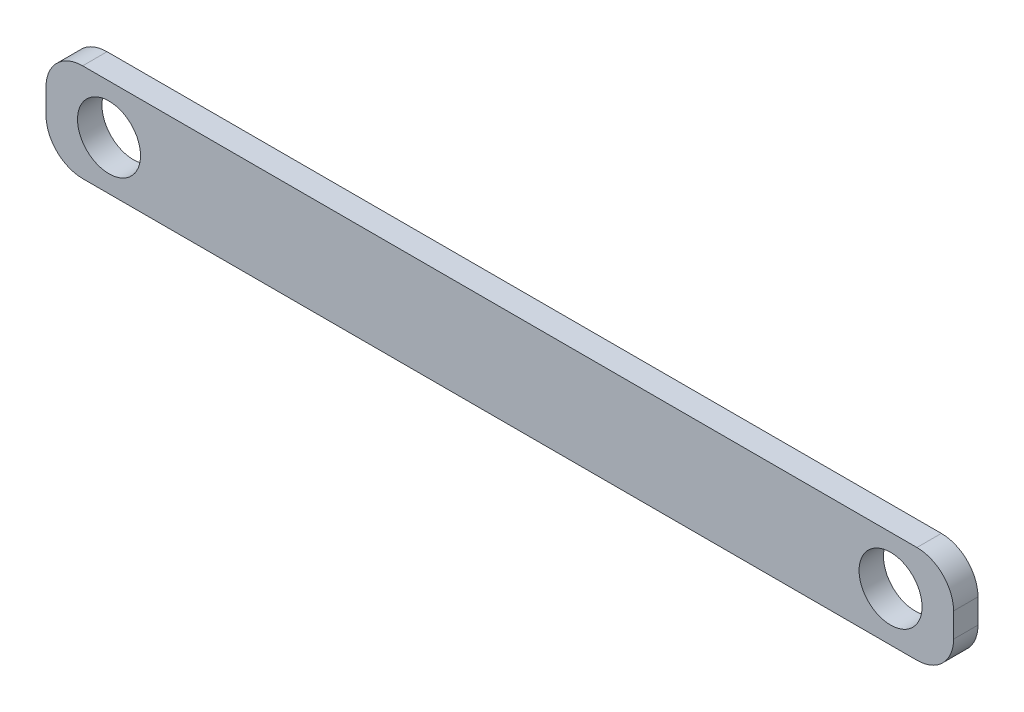
ISO-10303-21;
HEADER;
FILE_DESCRIPTION(('STEP AP214'),'2;1');
FILE_NAME('part.step','',(''),(''),'','','');
FILE_SCHEMA(('AUTOMOTIVE_DESIGN { 1 0 10303 214 1 1 1 1 }'));
ENDSEC;
DATA;
#1=APPLICATION_CONTEXT('core data for automotive mechanical design processes');
#2=APPLICATION_PROTOCOL_DEFINITION('international standard','automotive_design',2000,#1);
#3=PRODUCT_CONTEXT('',#1,'mechanical');
#4=PRODUCT('Part','Part','',(#3));
#5=PRODUCT_RELATED_PRODUCT_CATEGORY('part','',(#4));
#6=PRODUCT_DEFINITION_FORMATION('','',#4);
#7=PRODUCT_DEFINITION_CONTEXT('part definition',#1,'design');
#8=PRODUCT_DEFINITION('design','',#6,#7);
#9=PRODUCT_DEFINITION_SHAPE('','',#8);
#10=(LENGTH_UNIT() NAMED_UNIT(*) SI_UNIT(.MILLI.,.METRE.));
#11=(NAMED_UNIT(*) PLANE_ANGLE_UNIT() SI_UNIT($,.RADIAN.));
#12=(NAMED_UNIT(*) SI_UNIT($,.STERADIAN.) SOLID_ANGLE_UNIT());
#13=UNCERTAINTY_MEASURE_WITH_UNIT(LENGTH_MEASURE(1.E-05),#10,'distance_accuracy_value','');
#14=(GEOMETRIC_REPRESENTATION_CONTEXT(3) GLOBAL_UNCERTAINTY_ASSIGNED_CONTEXT((#13)) GLOBAL_UNIT_ASSIGNED_CONTEXT((#10,
#11,#12)) REPRESENTATION_CONTEXT('',''));
#15=CARTESIAN_POINT('',(0.,0.,0.));
#16=DIRECTION('',(0.,0.,1.));
#17=DIRECTION('',(1.,0.,0.));
#18=AXIS2_PLACEMENT_3D('',#15,#16,#17);
#19=CARTESIAN_POINT('',(0.,0.,5.));
#20=DIRECTION('',(0.,0.,-1.));
#21=DIRECTION('',(-1.,0.,0.));
#22=AXIS2_PLACEMENT_3D('',#19,#20,#21);
#23=PLANE('',#22);
#24=CARTESIAN_POINT('',(-80.,0.,5.));
#25=DIRECTION('',(0.,0.,1.));
#26=DIRECTION('',(1.,0.,0.));
#27=AXIS2_PLACEMENT_3D('',#24,#25,#26);
#28=CIRCLE('',#27,6.45);
#29=CARTESIAN_POINT('',(-73.55,0.,5.));
#30=VERTEX_POINT('',#29);
#31=EDGE_CURVE('E133',#30,#30,#28,.T.);
#32=ORIENTED_EDGE('',*,*,#31,.F.);
#33=EDGE_LOOP('',(#32));
#34=FACE_BOUND('',#33,.T.);
#35=DIRECTION('',(0.,-1.,0.));
#36=VECTOR('',#35,1.);
#37=CARTESIAN_POINT('',(-92.9,-10.,5.));
#38=LINE('',#37,#36);
#39=CARTESIAN_POINT('',(-92.9,2.49999999999999,5.));
#40=VERTEX_POINT('',#39);
#41=CARTESIAN_POINT('',(-92.9,-2.50000000000001,5.));
#42=VERTEX_POINT('',#41);
#43=EDGE_CURVE('E138',#40,#42,#38,.T.);
#44=ORIENTED_EDGE('',*,*,#43,.T.);
#45=CARTESIAN_POINT('',(-85.4,-2.50000000000001,5.));
#46=DIRECTION('',(0.,0.,-1.));
#47=DIRECTION('',(-1.,0.,0.));
#48=AXIS2_PLACEMENT_3D('',#45,#46,#47);
#49=CIRCLE('',#48,7.5);
#50=CARTESIAN_POINT('',(-85.4,-10.,5.));
#51=VERTEX_POINT('',#50);
#52=EDGE_CURVE('E152',#42,#51,#49,.F.);
#53=ORIENTED_EDGE('',*,*,#52,.T.);
#54=DIRECTION('',(1.,0.,0.));
#55=VECTOR('',#54,1.);
#56=CARTESIAN_POINT('',(-92.9,-10.,5.));
#57=LINE('',#56,#55);
#58=CARTESIAN_POINT('',(85.3999999999999,-9.99999999999999,5.));
#59=VERTEX_POINT('',#58);
#60=EDGE_CURVE('E119',#51,#59,#57,.T.);
#61=ORIENTED_EDGE('',*,*,#60,.T.);
#62=CARTESIAN_POINT('',(85.4,-2.49999999999999,5.));
#63=DIRECTION('',(0.,0.,-1.));
#64=DIRECTION('',(-1.,0.,0.));
#65=AXIS2_PLACEMENT_3D('',#62,#63,#64);
#66=CIRCLE('',#65,7.5);
#67=CARTESIAN_POINT('',(92.9,-2.49999999999999,5.));
#68=VERTEX_POINT('',#67);
#69=EDGE_CURVE('E148',#59,#68,#66,.F.);
#70=ORIENTED_EDGE('',*,*,#69,.T.);
#71=DIRECTION('',(0.,1.,0.));
#72=VECTOR('',#71,1.);
#73=CARTESIAN_POINT('',(92.9,-9.99999999999999,5.));
#74=LINE('',#73,#72);
#75=CARTESIAN_POINT('',(92.9,2.50000000000001,5.));
#76=VERTEX_POINT('',#75);
#77=EDGE_CURVE('E161',#68,#76,#74,.T.);
#78=ORIENTED_EDGE('',*,*,#77,.T.);
#79=CARTESIAN_POINT('',(85.4,2.50000000000001,5.));
#80=DIRECTION('',(0.,0.,-1.));
#81=DIRECTION('',(-1.,0.,0.));
#82=AXIS2_PLACEMENT_3D('',#79,#80,#81);
#83=CIRCLE('',#82,7.5);
#84=CARTESIAN_POINT('',(85.3999999999999,10.,5.));
#85=VERTEX_POINT('',#84);
#86=EDGE_CURVE('E54',#76,#85,#83,.F.);
#87=ORIENTED_EDGE('',*,*,#86,.T.);
#88=DIRECTION('',(-1.,0.,0.));
#89=VECTOR('',#88,1.);
#90=CARTESIAN_POINT('',(-92.9,9.99999999999999,5.));
#91=LINE('',#90,#89);
#92=CARTESIAN_POINT('',(-85.4,9.99999999999999,5.));
#93=VERTEX_POINT('',#92);
#94=EDGE_CURVE('E139',#85,#93,#91,.T.);
#95=ORIENTED_EDGE('',*,*,#94,.T.);
#96=CARTESIAN_POINT('',(-85.4,2.49999999999999,5.));
#97=DIRECTION('',(0.,0.,-1.));
#98=DIRECTION('',(-1.,0.,0.));
#99=AXIS2_PLACEMENT_3D('',#96,#97,#98);
#100=CIRCLE('',#99,7.5);
#101=EDGE_CURVE('E150',#93,#40,#100,.F.);
#102=ORIENTED_EDGE('',*,*,#101,.T.);
#103=EDGE_LOOP('',(#44,#53,#61,#70,#78,#87,#95,#102));
#104=FACE_BOUND('',#103,.T.);
#105=CARTESIAN_POINT('',(80.,0.,5.));
#106=DIRECTION('',(0.,0.,1.));
#107=DIRECTION('',(-1.,0.,0.));
#108=AXIS2_PLACEMENT_3D('',#105,#106,#107);
#109=CIRCLE('',#108,6.45);
#110=CARTESIAN_POINT('',(73.55,0.,5.));
#111=VERTEX_POINT('',#110);
#112=EDGE_CURVE('E184',#111,#111,#109,.T.);
#113=ORIENTED_EDGE('',*,*,#112,.F.);
#114=EDGE_LOOP('',(#113));
#115=FACE_BOUND('',#114,.T.);
#116=ADVANCED_FACE('F32',(#34,#104,#115),#23,.F.);
#117=CARTESIAN_POINT('',(0.,0.,0.));
#118=DIRECTION('',(0.,0.,-1.));
#119=DIRECTION('',(-1.,0.,0.));
#120=AXIS2_PLACEMENT_3D('',#117,#118,#119);
#121=PLANE('',#120);
#122=CARTESIAN_POINT('',(-80.,0.,0.));
#123=DIRECTION('',(0.,0.,1.));
#124=DIRECTION('',(1.,0.,0.));
#125=AXIS2_PLACEMENT_3D('',#122,#123,#124);
#126=CIRCLE('',#125,6.45);
#127=CARTESIAN_POINT('',(-73.55,0.,0.));
#128=VERTEX_POINT('',#127);
#129=EDGE_CURVE('E181',#128,#128,#126,.T.);
#130=ORIENTED_EDGE('',*,*,#129,.T.);
#131=EDGE_LOOP('',(#130));
#132=FACE_BOUND('',#131,.T.);
#133=DIRECTION('',(1.,0.,0.));
#134=VECTOR('',#133,1.);
#135=CARTESIAN_POINT('',(-92.9,-10.,0.));
#136=LINE('',#135,#134);
#137=CARTESIAN_POINT('',(-85.4,-10.,0.));
#138=VERTEX_POINT('',#137);
#139=CARTESIAN_POINT('',(85.3999999999999,-9.99999999999999,0.));
#140=VERTEX_POINT('',#139);
#141=EDGE_CURVE('E116',#138,#140,#136,.T.);
#142=ORIENTED_EDGE('',*,*,#141,.F.);
#143=CARTESIAN_POINT('',(-85.4,-2.50000000000001,0.));
#144=DIRECTION('',(0.,0.,-1.));
#145=DIRECTION('',(-1.,0.,0.));
#146=AXIS2_PLACEMENT_3D('',#143,#144,#145);
#147=CIRCLE('',#146,7.5);
#148=CARTESIAN_POINT('',(-92.9,-2.50000000000001,0.));
#149=VERTEX_POINT('',#148);
#150=EDGE_CURVE('E99',#138,#149,#147,.T.);
#151=ORIENTED_EDGE('',*,*,#150,.T.);
#152=DIRECTION('',(0.,-1.,0.));
#153=VECTOR('',#152,1.);
#154=CARTESIAN_POINT('',(-92.9,-10.,0.));
#155=LINE('',#154,#153);
#156=CARTESIAN_POINT('',(-92.9,2.49999999999999,0.));
#157=VERTEX_POINT('',#156);
#158=EDGE_CURVE('E128',#157,#149,#155,.T.);
#159=ORIENTED_EDGE('',*,*,#158,.F.);
#160=CARTESIAN_POINT('',(-85.4,2.49999999999999,0.));
#161=DIRECTION('',(0.,0.,-1.));
#162=DIRECTION('',(-1.,0.,0.));
#163=AXIS2_PLACEMENT_3D('',#160,#161,#162);
#164=CIRCLE('',#163,7.5);
#165=CARTESIAN_POINT('',(-85.4,9.99999999999999,0.));
#166=VERTEX_POINT('',#165);
#167=EDGE_CURVE('E110',#157,#166,#164,.T.);
#168=ORIENTED_EDGE('',*,*,#167,.T.);
#169=DIRECTION('',(-1.,0.,0.));
#170=VECTOR('',#169,1.);
#171=CARTESIAN_POINT('',(-92.9,9.99999999999999,0.));
#172=LINE('',#171,#170);
#173=CARTESIAN_POINT('',(85.3999999999999,10.,0.));
#174=VERTEX_POINT('',#173);
#175=EDGE_CURVE('E131',#174,#166,#172,.T.);
#176=ORIENTED_EDGE('',*,*,#175,.F.);
#177=CARTESIAN_POINT('',(85.4,2.50000000000001,0.));
#178=DIRECTION('',(0.,0.,-1.));
#179=DIRECTION('',(-1.,0.,0.));
#180=AXIS2_PLACEMENT_3D('',#177,#178,#179);
#181=CIRCLE('',#180,7.5);
#182=CARTESIAN_POINT('',(92.9,2.50000000000001,0.));
#183=VERTEX_POINT('',#182);
#184=EDGE_CURVE('E120',#174,#183,#181,.T.);
#185=ORIENTED_EDGE('',*,*,#184,.T.);
#186=DIRECTION('',(0.,1.,0.));
#187=VECTOR('',#186,1.);
#188=CARTESIAN_POINT('',(92.9,-9.99999999999999,0.));
#189=LINE('',#188,#187);
#190=CARTESIAN_POINT('',(92.9,-2.49999999999999,0.));
#191=VERTEX_POINT('',#190);
#192=EDGE_CURVE('E127',#191,#183,#189,.T.);
#193=ORIENTED_EDGE('',*,*,#192,.F.);
#194=CARTESIAN_POINT('',(85.4,-2.49999999999999,0.));
#195=DIRECTION('',(0.,0.,-1.));
#196=DIRECTION('',(-1.,0.,0.));
#197=AXIS2_PLACEMENT_3D('',#194,#195,#196);
#198=CIRCLE('',#197,7.5);
#199=EDGE_CURVE('E126',#191,#140,#198,.T.);
#200=ORIENTED_EDGE('',*,*,#199,.T.);
#201=EDGE_LOOP('',(#142,#151,#159,#168,#176,#185,#193,#200));
#202=FACE_BOUND('',#201,.T.);
#203=CARTESIAN_POINT('',(80.,0.,0.));
#204=DIRECTION('',(0.,0.,1.));
#205=DIRECTION('',(-1.,0.,0.));
#206=AXIS2_PLACEMENT_3D('',#203,#204,#205);
#207=CIRCLE('',#206,6.45);
#208=CARTESIAN_POINT('',(73.55,0.,0.));
#209=VERTEX_POINT('',#208);
#210=EDGE_CURVE('E187',#209,#209,#207,.T.);
#211=ORIENTED_EDGE('',*,*,#210,.T.);
#212=EDGE_LOOP('',(#211));
#213=FACE_BOUND('',#212,.T.);
#214=ADVANCED_FACE('F123',(#132,#202,#213),#121,.T.);
#215=CARTESIAN_POINT('',(-92.9,-10.,5.));
#216=DIRECTION('',(1.,0.,0.));
#217=DIRECTION('',(0.,0.,-1.));
#218=AXIS2_PLACEMENT_3D('',#215,#216,#217);
#219=PLANE('',#218);
#220=ORIENTED_EDGE('',*,*,#158,.T.);
#221=DIRECTION('',(0.,0.,-1.));
#222=VECTOR('',#221,1.);
#223=CARTESIAN_POINT('',(-92.9,-2.50000000000001,5.));
#224=LINE('',#223,#222);
#225=EDGE_CURVE('E104',#149,#42,#224,.F.);
#226=ORIENTED_EDGE('',*,*,#225,.T.);
#227=ORIENTED_EDGE('',*,*,#43,.F.);
#228=DIRECTION('',(0.,0.,-1.));
#229=VECTOR('',#228,1.);
#230=CARTESIAN_POINT('',(-92.9,2.49999999999999,5.));
#231=LINE('',#230,#229);
#232=EDGE_CURVE('E109',#40,#157,#231,.T.);
#233=ORIENTED_EDGE('',*,*,#232,.T.);
#234=EDGE_LOOP('',(#220,#226,#227,#233));
#235=FACE_BOUND('',#234,.T.);
#236=ADVANCED_FACE('F177',(#235),#219,.F.);
#237=CARTESIAN_POINT('',(-92.9,-10.,5.));
#238=DIRECTION('',(0.,1.,0.));
#239=DIRECTION('',(-1.,0.,0.));
#240=AXIS2_PLACEMENT_3D('',#237,#238,#239);
#241=PLANE('',#240);
#242=ORIENTED_EDGE('',*,*,#60,.F.);
#243=DIRECTION('',(0.,0.,-1.));
#244=VECTOR('',#243,1.);
#245=CARTESIAN_POINT('',(-85.4,-10.,5.));
#246=LINE('',#245,#244);
#247=EDGE_CURVE('E103',#51,#138,#246,.T.);
#248=ORIENTED_EDGE('',*,*,#247,.T.);
#249=ORIENTED_EDGE('',*,*,#141,.T.);
#250=DIRECTION('',(0.,0.,-1.));
#251=VECTOR('',#250,1.);
#252=CARTESIAN_POINT('',(85.4,-9.99999999999999,5.));
#253=LINE('',#252,#251);
#254=EDGE_CURVE('E121',#140,#59,#253,.F.);
#255=ORIENTED_EDGE('',*,*,#254,.T.);
#256=EDGE_LOOP('',(#242,#248,#249,#255));
#257=FACE_BOUND('',#256,.T.);
#258=ADVANCED_FACE('F115',(#257),#241,.F.);
#259=CARTESIAN_POINT('',(92.9,-9.99999999999999,5.));
#260=DIRECTION('',(-1.,0.,0.));
#261=DIRECTION('',(0.,0.,1.));
#262=AXIS2_PLACEMENT_3D('',#259,#260,#261);
#263=PLANE('',#262);
#264=ORIENTED_EDGE('',*,*,#77,.F.);
#265=DIRECTION('',(0.,0.,-1.));
#266=VECTOR('',#265,1.);
#267=CARTESIAN_POINT('',(92.9,-2.49999999999999,5.));
#268=LINE('',#267,#266);
#269=EDGE_CURVE('E11',#68,#191,#268,.T.);
#270=ORIENTED_EDGE('',*,*,#269,.T.);
#271=ORIENTED_EDGE('',*,*,#192,.T.);
#272=DIRECTION('',(0.,0.,-1.));
#273=VECTOR('',#272,1.);
#274=CARTESIAN_POINT('',(92.9,2.50000000000001,5.));
#275=LINE('',#274,#273);
#276=EDGE_CURVE('E40',#183,#76,#275,.F.);
#277=ORIENTED_EDGE('',*,*,#276,.T.);
#278=EDGE_LOOP('',(#264,#270,#271,#277));
#279=FACE_BOUND('',#278,.T.);
#280=ADVANCED_FACE('F160',(#279),#263,.F.);
#281=CARTESIAN_POINT('',(-92.9,9.99999999999999,5.));
#282=DIRECTION('',(0.,-1.,0.));
#283=DIRECTION('',(1.,0.,0.));
#284=AXIS2_PLACEMENT_3D('',#281,#282,#283);
#285=PLANE('',#284);
#286=ORIENTED_EDGE('',*,*,#175,.T.);
#287=DIRECTION('',(0.,0.,-1.));
#288=VECTOR('',#287,1.);
#289=CARTESIAN_POINT('',(-85.4,9.99999999999999,5.));
#290=LINE('',#289,#288);
#291=EDGE_CURVE('E47',#166,#93,#290,.F.);
#292=ORIENTED_EDGE('',*,*,#291,.T.);
#293=ORIENTED_EDGE('',*,*,#94,.F.);
#294=DIRECTION('',(0.,0.,-1.));
#295=VECTOR('',#294,1.);
#296=CARTESIAN_POINT('',(85.4,10.,5.));
#297=LINE('',#296,#295);
#298=EDGE_CURVE('E154',#85,#174,#297,.T.);
#299=ORIENTED_EDGE('',*,*,#298,.T.);
#300=EDGE_LOOP('',(#286,#292,#293,#299));
#301=FACE_BOUND('',#300,.T.);
#302=ADVANCED_FACE('F170',(#301),#285,.F.);
#303=CARTESIAN_POINT('',(-80.,0.,5.));
#304=DIRECTION('',(0.,0.,-1.));
#305=DIRECTION('',(-1.,0.,0.));
#306=AXIS2_PLACEMENT_3D('',#303,#304,#305);
#307=CYLINDRICAL_SURFACE('',#306,6.45);
#308=ORIENTED_EDGE('',*,*,#31,.T.);
#309=EDGE_LOOP('',(#308));
#310=FACE_BOUND('',#309,.T.);
#311=ORIENTED_EDGE('',*,*,#129,.F.);
#312=EDGE_LOOP('',(#311));
#313=FACE_BOUND('',#312,.T.);
#314=ADVANCED_FACE('F205',(#310,#313),#307,.F.);
#315=CARTESIAN_POINT('',(80.,0.,5.));
#316=DIRECTION('',(0.,0.,-1.));
#317=DIRECTION('',(-1.,0.,0.));
#318=AXIS2_PLACEMENT_3D('',#315,#316,#317);
#319=CYLINDRICAL_SURFACE('',#318,6.45);
#320=ORIENTED_EDGE('',*,*,#112,.T.);
#321=EDGE_LOOP('',(#320));
#322=FACE_BOUND('',#321,.T.);
#323=ORIENTED_EDGE('',*,*,#210,.F.);
#324=EDGE_LOOP('',(#323));
#325=FACE_BOUND('',#324,.T.);
#326=ADVANCED_FACE('F193',(#322,#325),#319,.F.);
#327=CARTESIAN_POINT('',(-85.4,-2.50000000000001,5.));
#328=DIRECTION('',(0.,0.,-1.));
#329=DIRECTION('',(-1.,0.,0.));
#330=AXIS2_PLACEMENT_3D('',#327,#328,#329);
#331=CYLINDRICAL_SURFACE('',#330,7.5);
#332=ORIENTED_EDGE('',*,*,#52,.F.);
#333=ORIENTED_EDGE('',*,*,#225,.F.);
#334=ORIENTED_EDGE('',*,*,#150,.F.);
#335=ORIENTED_EDGE('',*,*,#247,.F.);
#336=EDGE_LOOP('',(#332,#333,#334,#335));
#337=FACE_BOUND('',#336,.T.);
#338=ADVANCED_FACE('F102',(#337),#331,.T.);
#339=CARTESIAN_POINT('',(-85.4,2.49999999999999,5.));
#340=DIRECTION('',(0.,0.,-1.));
#341=DIRECTION('',(-1.,0.,0.));
#342=AXIS2_PLACEMENT_3D('',#339,#340,#341);
#343=CYLINDRICAL_SURFACE('',#342,7.5);
#344=ORIENTED_EDGE('',*,*,#101,.F.);
#345=ORIENTED_EDGE('',*,*,#291,.F.);
#346=ORIENTED_EDGE('',*,*,#167,.F.);
#347=ORIENTED_EDGE('',*,*,#232,.F.);
#348=EDGE_LOOP('',(#344,#345,#346,#347));
#349=FACE_BOUND('',#348,.T.);
#350=ADVANCED_FACE('F174',(#349),#343,.T.);
#351=CARTESIAN_POINT('',(85.4,-2.49999999999999,5.));
#352=DIRECTION('',(0.,0.,-1.));
#353=DIRECTION('',(-1.,0.,0.));
#354=AXIS2_PLACEMENT_3D('',#351,#352,#353);
#355=CYLINDRICAL_SURFACE('',#354,7.5);
#356=ORIENTED_EDGE('',*,*,#69,.F.);
#357=ORIENTED_EDGE('',*,*,#254,.F.);
#358=ORIENTED_EDGE('',*,*,#199,.F.);
#359=ORIENTED_EDGE('',*,*,#269,.F.);
#360=EDGE_LOOP('',(#356,#357,#358,#359));
#361=FACE_BOUND('',#360,.T.);
#362=ADVANCED_FACE('F219',(#361),#355,.T.);
#363=CARTESIAN_POINT('',(85.4,2.50000000000001,5.));
#364=DIRECTION('',(0.,0.,-1.));
#365=DIRECTION('',(-1.,0.,0.));
#366=AXIS2_PLACEMENT_3D('',#363,#364,#365);
#367=CYLINDRICAL_SURFACE('',#366,7.5);
#368=ORIENTED_EDGE('',*,*,#86,.F.);
#369=ORIENTED_EDGE('',*,*,#276,.F.);
#370=ORIENTED_EDGE('',*,*,#184,.F.);
#371=ORIENTED_EDGE('',*,*,#298,.F.);
#372=EDGE_LOOP('',(#368,#369,#370,#371));
#373=FACE_BOUND('',#372,.T.);
#374=ADVANCED_FACE('F34',(#373),#367,.T.);
#375=CLOSED_SHELL('',(#116,#214,#236,#258,#280,#302,#314,#326,#338,#350,#362,#374));
#376=MANIFOLD_SOLID_BREP('B2',#375);
#377=ADVANCED_BREP_SHAPE_REPRESENTATION('',(#18,#376),#14);
#378=SHAPE_DEFINITION_REPRESENTATION(#9,#377);
ENDSEC;
END-ISO-10303-21;
